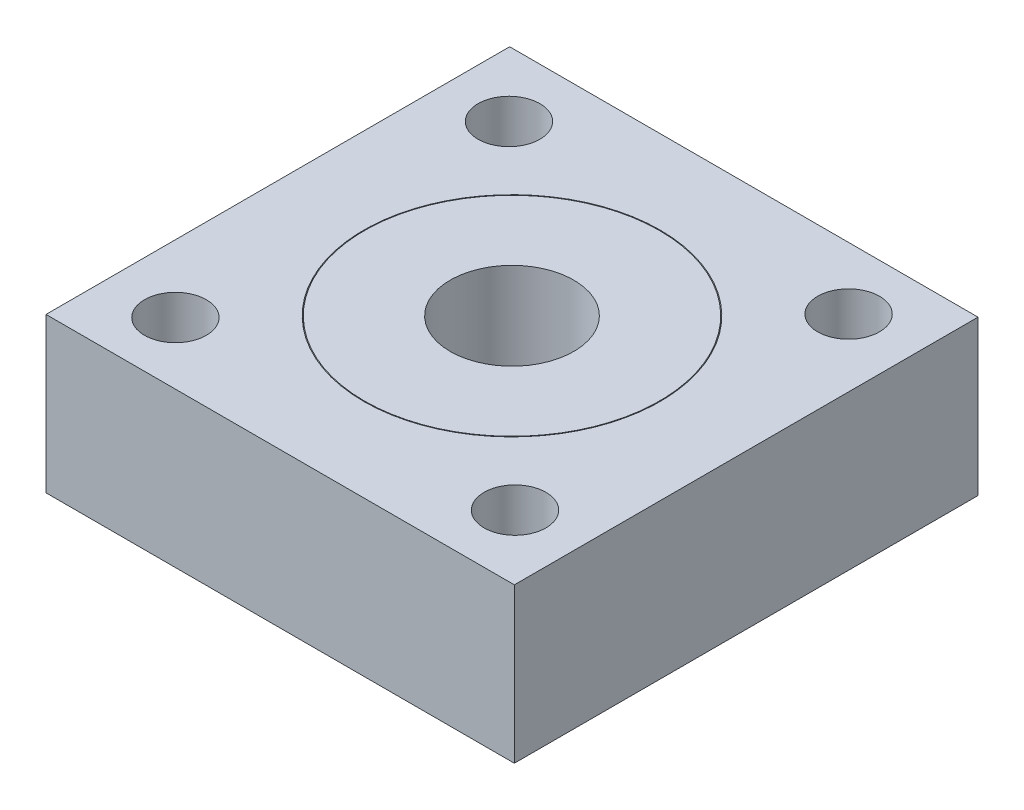
ISO-10303-21;
HEADER;
FILE_DESCRIPTION(('STEP AP214'),'2;1');
FILE_NAME('part.step','',(''),(''),'','','');
FILE_SCHEMA(('AUTOMOTIVE_DESIGN { 1 0 10303 214 1 1 1 1 }'));
ENDSEC;
DATA;
#1=APPLICATION_CONTEXT('core data for automotive mechanical design processes');
#2=APPLICATION_PROTOCOL_DEFINITION('international standard','automotive_design',2000,#1);
#3=PRODUCT_CONTEXT('',#1,'mechanical');
#4=PRODUCT('Part','Part','',(#3));
#5=PRODUCT_RELATED_PRODUCT_CATEGORY('part','',(#4));
#6=PRODUCT_DEFINITION_FORMATION('','',#4);
#7=PRODUCT_DEFINITION_CONTEXT('part definition',#1,'design');
#8=PRODUCT_DEFINITION('design','',#6,#7);
#9=PRODUCT_DEFINITION_SHAPE('','',#8);
#10=(LENGTH_UNIT() NAMED_UNIT(*) SI_UNIT(.MILLI.,.METRE.));
#11=(NAMED_UNIT(*) PLANE_ANGLE_UNIT() SI_UNIT($,.RADIAN.));
#12=(NAMED_UNIT(*) SI_UNIT($,.STERADIAN.) SOLID_ANGLE_UNIT());
#13=UNCERTAINTY_MEASURE_WITH_UNIT(LENGTH_MEASURE(1.E-05),#10,'distance_accuracy_value','');
#14=(GEOMETRIC_REPRESENTATION_CONTEXT(3) GLOBAL_UNCERTAINTY_ASSIGNED_CONTEXT((#13)) GLOBAL_UNIT_ASSIGNED_CONTEXT((#10,
#11,#12)) REPRESENTATION_CONTEXT('',''));
#15=CARTESIAN_POINT('',(0.,0.,0.));
#16=DIRECTION('',(0.,0.,1.));
#17=DIRECTION('',(1.,0.,0.));
#18=AXIS2_PLACEMENT_3D('',#15,#16,#17);
#19=CARTESIAN_POINT('',(15.1536935046579,10.,-15.0012802669847));
#20=DIRECTION('',(-1.,0.,0.));
#21=DIRECTION('',(0.,0.,1.));
#22=AXIS2_PLACEMENT_3D('',#19,#20,#21);
#23=PLANE('',#22);
#24=DIRECTION('',(0.,0.,-1.));
#25=VECTOR('',#24,1.);
#26=CARTESIAN_POINT('',(15.1536935046579,0.,-15.0012802669847));
#27=LINE('',#26,#25);
#28=CARTESIAN_POINT('',(15.1536935046579,0.,15.0012802669847));
#29=VERTEX_POINT('',#28);
#30=CARTESIAN_POINT('',(15.1536935046579,0.,-15.0012802669847));
#31=VERTEX_POINT('',#30);
#32=EDGE_CURVE('E99',#29,#31,#27,.T.);
#33=ORIENTED_EDGE('',*,*,#32,.T.);
#34=DIRECTION('',(0.,-1.,0.));
#35=VECTOR('',#34,1.);
#36=CARTESIAN_POINT('',(15.1536935046579,10.,-15.0012802669847));
#37=LINE('',#36,#35);
#38=CARTESIAN_POINT('',(15.1536935046579,10.,-15.0012802669847));
#39=VERTEX_POINT('',#38);
#40=EDGE_CURVE('E11',#39,#31,#37,.T.);
#41=ORIENTED_EDGE('',*,*,#40,.F.);
#42=DIRECTION('',(0.,0.,-1.));
#43=VECTOR('',#42,1.);
#44=CARTESIAN_POINT('',(15.1536935046579,10.,-15.0012802669847));
#45=LINE('',#44,#43);
#46=CARTESIAN_POINT('',(15.1536935046579,10.,15.0012802669847));
#47=VERTEX_POINT('',#46);
#48=EDGE_CURVE('E87',#47,#39,#45,.T.);
#49=ORIENTED_EDGE('',*,*,#48,.F.);
#50=DIRECTION('',(0.,-1.,0.));
#51=VECTOR('',#50,1.);
#52=CARTESIAN_POINT('',(15.1536935046579,10.,15.0012802669847));
#53=LINE('',#52,#51);
#54=EDGE_CURVE('E95',#47,#29,#53,.T.);
#55=ORIENTED_EDGE('',*,*,#54,.T.);
#56=EDGE_LOOP('',(#33,#41,#49,#55));
#57=FACE_BOUND('',#56,.T.);
#58=ADVANCED_FACE('F36',(#57),#23,.F.);
#59=CARTESIAN_POINT('',(-15.1536935046579,10.,-15.0012802669847));
#60=DIRECTION('',(0.,0.,1.));
#61=DIRECTION('',(1.,0.,0.));
#62=AXIS2_PLACEMENT_3D('',#59,#60,#61);
#63=PLANE('',#62);
#64=DIRECTION('',(-1.,0.,0.));
#65=VECTOR('',#64,1.);
#66=CARTESIAN_POINT('',(-15.1536935046579,0.,-15.0012802669847));
#67=LINE('',#66,#65);
#68=CARTESIAN_POINT('',(-15.1536935046579,0.,-15.0012802669847));
#69=VERTEX_POINT('',#68);
#70=EDGE_CURVE('E91',#31,#69,#67,.T.);
#71=ORIENTED_EDGE('',*,*,#70,.T.);
#72=DIRECTION('',(0.,-1.,0.));
#73=VECTOR('',#72,1.);
#74=CARTESIAN_POINT('',(-15.1536935046579,10.,-15.0012802669847));
#75=LINE('',#74,#73);
#76=CARTESIAN_POINT('',(-15.1536935046579,10.,-15.0012802669847));
#77=VERTEX_POINT('',#76);
#78=EDGE_CURVE('E44',#77,#69,#75,.T.);
#79=ORIENTED_EDGE('',*,*,#78,.F.);
#80=DIRECTION('',(-1.,0.,0.));
#81=VECTOR('',#80,1.);
#82=CARTESIAN_POINT('',(-15.1536935046579,10.,-15.0012802669847));
#83=LINE('',#82,#81);
#84=EDGE_CURVE('E82',#39,#77,#83,.T.);
#85=ORIENTED_EDGE('',*,*,#84,.F.);
#86=ORIENTED_EDGE('',*,*,#40,.T.);
#87=EDGE_LOOP('',(#71,#79,#85,#86));
#88=FACE_BOUND('',#87,.T.);
#89=ADVANCED_FACE('F90',(#88),#63,.F.);
#90=CARTESIAN_POINT('',(-15.1536935046579,10.,-15.0012802669847));
#91=DIRECTION('',(1.,0.,0.));
#92=DIRECTION('',(0.,0.,-1.));
#93=AXIS2_PLACEMENT_3D('',#90,#91,#92);
#94=PLANE('',#93);
#95=DIRECTION('',(0.,0.,1.));
#96=VECTOR('',#95,1.);
#97=CARTESIAN_POINT('',(-15.1536935046579,0.,-15.0012802669847));
#98=LINE('',#97,#96);
#99=CARTESIAN_POINT('',(-15.1536935046579,0.,15.0012802669847));
#100=VERTEX_POINT('',#99);
#101=EDGE_CURVE('E69',#69,#100,#98,.T.);
#102=ORIENTED_EDGE('',*,*,#101,.T.);
#103=DIRECTION('',(0.,-1.,0.));
#104=VECTOR('',#103,1.);
#105=CARTESIAN_POINT('',(-15.1536935046579,10.,15.0012802669847));
#106=LINE('',#105,#104);
#107=CARTESIAN_POINT('',(-15.1536935046579,10.,15.0012802669847));
#108=VERTEX_POINT('',#107);
#109=EDGE_CURVE('E92',#108,#100,#106,.T.);
#110=ORIENTED_EDGE('',*,*,#109,.F.);
#111=DIRECTION('',(0.,0.,1.));
#112=VECTOR('',#111,1.);
#113=CARTESIAN_POINT('',(-15.1536935046579,10.,-15.0012802669847));
#114=LINE('',#113,#112);
#115=EDGE_CURVE('E85',#77,#108,#114,.T.);
#116=ORIENTED_EDGE('',*,*,#115,.F.);
#117=ORIENTED_EDGE('',*,*,#78,.T.);
#118=EDGE_LOOP('',(#102,#110,#116,#117));
#119=FACE_BOUND('',#118,.T.);
#120=ADVANCED_FACE('F93',(#119),#94,.F.);
#121=CARTESIAN_POINT('',(-15.1536935046579,10.,15.0012802669847));
#122=DIRECTION('',(0.,0.,-1.));
#123=DIRECTION('',(-1.,0.,0.));
#124=AXIS2_PLACEMENT_3D('',#121,#122,#123);
#125=PLANE('',#124);
#126=DIRECTION('',(1.,0.,0.));
#127=VECTOR('',#126,1.);
#128=CARTESIAN_POINT('',(-15.1536935046579,0.,15.0012802669847));
#129=LINE('',#128,#127);
#130=EDGE_CURVE('E75',#100,#29,#129,.T.);
#131=ORIENTED_EDGE('',*,*,#130,.T.);
#132=ORIENTED_EDGE('',*,*,#54,.F.);
#133=DIRECTION('',(1.,0.,0.));
#134=VECTOR('',#133,1.);
#135=CARTESIAN_POINT('',(-15.1536935046579,10.,15.0012802669847));
#136=LINE('',#135,#134);
#137=EDGE_CURVE('E52',#108,#47,#136,.T.);
#138=ORIENTED_EDGE('',*,*,#137,.F.);
#139=ORIENTED_EDGE('',*,*,#109,.T.);
#140=EDGE_LOOP('',(#131,#132,#138,#139));
#141=FACE_BOUND('',#140,.T.);
#142=ADVANCED_FACE('F107',(#141),#125,.F.);
#143=CARTESIAN_POINT('',(0.,10.,0.));
#144=DIRECTION('',(0.,1.,0.));
#145=DIRECTION('',(0.,0.,1.));
#146=AXIS2_PLACEMENT_3D('',#143,#144,#145);
#147=PLANE('',#146);
#148=CARTESIAN_POINT('',(-10.9875097580016,10.,-10.7923497267759));
#149=DIRECTION('',(0.,1.,0.));
#150=DIRECTION('',(1.,0.,0.));
#151=AXIS2_PLACEMENT_3D('',#148,#149,#150);
#152=CIRCLE('',#151,2.);
#153=CARTESIAN_POINT('',(-8.98750975800163,10.,-10.7923497267759));
#154=VERTEX_POINT('',#153);
#155=EDGE_CURVE('E134',#154,#154,#152,.T.);
#156=ORIENTED_EDGE('',*,*,#155,.F.);
#157=EDGE_LOOP('',(#156));
#158=FACE_BOUND('',#157,.T.);
#159=CARTESIAN_POINT('',(-10.792349726776,10.,10.9875097580016));
#160=DIRECTION('',(0.,1.,0.));
#161=DIRECTION('',(0.,0.,-1.));
#162=AXIS2_PLACEMENT_3D('',#159,#160,#161);
#163=CIRCLE('',#162,2.);
#164=CARTESIAN_POINT('',(-10.792349726776,10.,8.9875097580016));
#165=VERTEX_POINT('',#164);
#166=EDGE_CURVE('E144',#165,#165,#163,.T.);
#167=ORIENTED_EDGE('',*,*,#166,.F.);
#168=EDGE_LOOP('',(#167));
#169=FACE_BOUND('',#168,.T.);
#170=CARTESIAN_POINT('',(10.9875097580017,10.,10.7923497267758));
#171=DIRECTION('',(0.,1.,0.));
#172=DIRECTION('',(-1.,0.,0.));
#173=AXIS2_PLACEMENT_3D('',#170,#171,#172);
#174=CIRCLE('',#173,2.);
#175=CARTESIAN_POINT('',(8.98750975800171,10.,10.7923497267759));
#176=VERTEX_POINT('',#175);
#177=EDGE_CURVE('E137',#176,#176,#174,.T.);
#178=ORIENTED_EDGE('',*,*,#177,.F.);
#179=EDGE_LOOP('',(#178));
#180=FACE_BOUND('',#179,.T.);
#181=CARTESIAN_POINT('',(10.792349726776,10.,-10.9875097580016));
#182=DIRECTION('',(0.,1.,0.));
#183=DIRECTION('',(0.,0.,1.));
#184=AXIS2_PLACEMENT_3D('',#181,#182,#183);
#185=CIRCLE('',#184,2.);
#186=CARTESIAN_POINT('',(10.792349726776,10.,-8.9875097580016));
#187=VERTEX_POINT('',#186);
#188=EDGE_CURVE('E131',#187,#187,#185,.T.);
#189=ORIENTED_EDGE('',*,*,#188,.F.);
#190=EDGE_LOOP('',(#189));
#191=FACE_BOUND('',#190,.T.);
#192=CARTESIAN_POINT('',(0.,10.,0.));
#193=DIRECTION('',(0.,1.,0.));
#194=DIRECTION('',(0.,0.,1.));
#195=AXIS2_PLACEMENT_3D('',#192,#193,#194);
#196=CIRCLE('',#195,9.6);
#197=CARTESIAN_POINT('',(0.,10.,9.6));
#198=VERTEX_POINT('',#197);
#199=EDGE_CURVE('E113',#198,#198,#196,.T.);
#200=ORIENTED_EDGE('',*,*,#199,.F.);
#201=EDGE_LOOP('',(#200));
#202=FACE_BOUND('',#201,.T.);
#203=ORIENTED_EDGE('',*,*,#48,.T.);
#204=ORIENTED_EDGE('',*,*,#84,.T.);
#205=ORIENTED_EDGE('',*,*,#115,.T.);
#206=ORIENTED_EDGE('',*,*,#137,.T.);
#207=EDGE_LOOP('',(#203,#204,#205,#206));
#208=FACE_BOUND('',#207,.T.);
#209=ADVANCED_FACE('F83',(#158,#169,#180,#191,#202,#208),#147,.T.);
#210=CARTESIAN_POINT('',(0.,0.,0.));
#211=DIRECTION('',(0.,1.,0.));
#212=DIRECTION('',(0.,0.,1.));
#213=AXIS2_PLACEMENT_3D('',#210,#211,#212);
#214=PLANE('',#213);
#215=CARTESIAN_POINT('',(-10.9875097580016,0.,-10.7923497267759));
#216=DIRECTION('',(0.,1.,0.));
#217=DIRECTION('',(1.,0.,0.));
#218=AXIS2_PLACEMENT_3D('',#215,#216,#217);
#219=CIRCLE('',#218,2.);
#220=CARTESIAN_POINT('',(-8.98750975800163,0.,-10.7923497267759));
#221=VERTEX_POINT('',#220);
#222=EDGE_CURVE('E147',#221,#221,#219,.T.);
#223=ORIENTED_EDGE('',*,*,#222,.T.);
#224=EDGE_LOOP('',(#223));
#225=FACE_BOUND('',#224,.T.);
#226=CARTESIAN_POINT('',(-10.792349726776,0.,10.9875097580016));
#227=DIRECTION('',(0.,1.,0.));
#228=DIRECTION('',(0.,0.,-1.));
#229=AXIS2_PLACEMENT_3D('',#226,#227,#228);
#230=CIRCLE('',#229,2.);
#231=CARTESIAN_POINT('',(-10.792349726776,0.,8.9875097580016));
#232=VERTEX_POINT('',#231);
#233=EDGE_CURVE('E140',#232,#232,#230,.T.);
#234=ORIENTED_EDGE('',*,*,#233,.T.);
#235=EDGE_LOOP('',(#234));
#236=FACE_BOUND('',#235,.T.);
#237=CARTESIAN_POINT('',(10.9875097580017,0.,10.7923497267758));
#238=DIRECTION('',(0.,1.,0.));
#239=DIRECTION('',(-1.,0.,0.));
#240=AXIS2_PLACEMENT_3D('',#237,#238,#239);
#241=CIRCLE('',#240,2.);
#242=CARTESIAN_POINT('',(8.98750975800171,0.,10.7923497267759));
#243=VERTEX_POINT('',#242);
#244=EDGE_CURVE('E141',#243,#243,#241,.T.);
#245=ORIENTED_EDGE('',*,*,#244,.T.);
#246=EDGE_LOOP('',(#245));
#247=FACE_BOUND('',#246,.T.);
#248=CARTESIAN_POINT('',(10.792349726776,0.,-10.9875097580016));
#249=DIRECTION('',(0.,1.,0.));
#250=DIRECTION('',(0.,0.,1.));
#251=AXIS2_PLACEMENT_3D('',#248,#249,#250);
#252=CIRCLE('',#251,2.);
#253=CARTESIAN_POINT('',(10.792349726776,0.,-8.9875097580016));
#254=VERTEX_POINT('',#253);
#255=EDGE_CURVE('E128',#254,#254,#252,.T.);
#256=ORIENTED_EDGE('',*,*,#255,.T.);
#257=EDGE_LOOP('',(#256));
#258=FACE_BOUND('',#257,.T.);
#259=CARTESIAN_POINT('',(0.,0.,0.));
#260=DIRECTION('',(0.,1.,0.));
#261=DIRECTION('',(0.,0.,1.));
#262=AXIS2_PLACEMENT_3D('',#259,#260,#261);
#263=CIRCLE('',#262,4.);
#264=CARTESIAN_POINT('',(0.,0.,4.));
#265=VERTEX_POINT('',#264);
#266=EDGE_CURVE('E122',#265,#265,#263,.T.);
#267=ORIENTED_EDGE('',*,*,#266,.T.);
#268=EDGE_LOOP('',(#267));
#269=FACE_BOUND('',#268,.T.);
#270=ORIENTED_EDGE('',*,*,#32,.F.);
#271=ORIENTED_EDGE('',*,*,#130,.F.);
#272=ORIENTED_EDGE('',*,*,#101,.F.);
#273=ORIENTED_EDGE('',*,*,#70,.F.);
#274=EDGE_LOOP('',(#270,#271,#272,#273));
#275=FACE_BOUND('',#274,.T.);
#276=ADVANCED_FACE('F110',(#225,#236,#247,#258,#269,#275),#214,.F.);
#277=CARTESIAN_POINT('',(0.,3.,0.));
#278=DIRECTION('',(0.,1.,0.));
#279=DIRECTION('',(0.,0.,1.));
#280=AXIS2_PLACEMENT_3D('',#277,#278,#279);
#281=CYLINDRICAL_SURFACE('',#280,9.6);
#282=CARTESIAN_POINT('',(0.,3.,0.));
#283=DIRECTION('',(0.,1.,0.));
#284=DIRECTION('',(0.,0.,1.));
#285=AXIS2_PLACEMENT_3D('',#282,#283,#284);
#286=CIRCLE('',#285,9.6);
#287=CARTESIAN_POINT('',(0.,3.,9.6));
#288=VERTEX_POINT('',#287);
#289=EDGE_CURVE('E102',#288,#288,#286,.T.);
#290=ORIENTED_EDGE('',*,*,#289,.F.);
#291=EDGE_LOOP('',(#290));
#292=FACE_BOUND('',#291,.T.);
#293=ORIENTED_EDGE('',*,*,#199,.T.);
#294=EDGE_LOOP('',(#293));
#295=FACE_BOUND('',#294,.T.);
#296=ADVANCED_FACE('F176',(#292,#295),#281,.F.);
#297=CARTESIAN_POINT('',(0.,3.,0.));
#298=DIRECTION('',(0.,1.,0.));
#299=DIRECTION('',(0.,0.,1.));
#300=AXIS2_PLACEMENT_3D('',#297,#298,#299);
#301=PLANE('',#300);
#302=CARTESIAN_POINT('',(0.,3.,0.));
#303=DIRECTION('',(0.,1.,0.));
#304=DIRECTION('',(0.,0.,1.));
#305=AXIS2_PLACEMENT_3D('',#302,#303,#304);
#306=CIRCLE('',#305,9.55);
#307=CARTESIAN_POINT('',(0.,3.,9.55));
#308=VERTEX_POINT('',#307);
#309=EDGE_CURVE('E116',#308,#308,#306,.T.);
#310=ORIENTED_EDGE('',*,*,#309,.F.);
#311=EDGE_LOOP('',(#310));
#312=FACE_BOUND('',#311,.T.);
#313=ORIENTED_EDGE('',*,*,#289,.T.);
#314=EDGE_LOOP('',(#313));
#315=FACE_BOUND('',#314,.T.);
#316=ADVANCED_FACE('F178',(#312,#315),#301,.T.);
#317=CARTESIAN_POINT('',(0.,3.,0.));
#318=DIRECTION('',(0.,1.,0.));
#319=DIRECTION('',(0.,0.,1.));
#320=AXIS2_PLACEMENT_3D('',#317,#318,#319);
#321=CYLINDRICAL_SURFACE('',#320,9.55);
#322=ORIENTED_EDGE('',*,*,#309,.T.);
#323=EDGE_LOOP('',(#322));
#324=FACE_BOUND('',#323,.T.);
#325=CARTESIAN_POINT('',(0.,10.,0.));
#326=DIRECTION('',(0.,1.,0.));
#327=DIRECTION('',(0.,0.,1.));
#328=AXIS2_PLACEMENT_3D('',#325,#326,#327);
#329=CIRCLE('',#328,9.55);
#330=CARTESIAN_POINT('',(0.,10.,9.55));
#331=VERTEX_POINT('',#330);
#332=EDGE_CURVE('E119',#331,#331,#329,.T.);
#333=ORIENTED_EDGE('',*,*,#332,.F.);
#334=EDGE_LOOP('',(#333));
#335=FACE_BOUND('',#334,.T.);
#336=ADVANCED_FACE('F185',(#324,#335),#321,.T.);
#337=CARTESIAN_POINT('',(0.,10.,0.));
#338=DIRECTION('',(0.,1.,0.));
#339=DIRECTION('',(0.,0.,1.));
#340=AXIS2_PLACEMENT_3D('',#337,#338,#339);
#341=CIRCLE('',#340,4.);
#342=CARTESIAN_POINT('',(0.,10.,4.));
#343=VERTEX_POINT('',#342);
#344=EDGE_CURVE('E125',#343,#343,#341,.T.);
#345=ORIENTED_EDGE('',*,*,#344,.F.);
#346=EDGE_LOOP('',(#345));
#347=FACE_BOUND('',#346,.T.);
#348=ORIENTED_EDGE('',*,*,#332,.T.);
#349=EDGE_LOOP('',(#348));
#350=FACE_BOUND('',#349,.T.);
#351=ADVANCED_FACE('F167',(#347,#350),#147,.T.);
#352=CARTESIAN_POINT('',(0.,0.,0.));
#353=DIRECTION('',(0.,1.,0.));
#354=DIRECTION('',(0.,0.,1.));
#355=AXIS2_PLACEMENT_3D('',#352,#353,#354);
#356=CYLINDRICAL_SURFACE('',#355,4.);
#357=ORIENTED_EDGE('',*,*,#266,.F.);
#358=EDGE_LOOP('',(#357));
#359=FACE_BOUND('',#358,.T.);
#360=ORIENTED_EDGE('',*,*,#344,.T.);
#361=EDGE_LOOP('',(#360));
#362=FACE_BOUND('',#361,.T.);
#363=ADVANCED_FACE('F250',(#359,#362),#356,.F.);
#364=CARTESIAN_POINT('',(10.792349726776,0.,-10.9875097580016));
#365=DIRECTION('',(0.,1.,0.));
#366=DIRECTION('',(0.,0.,1.));
#367=AXIS2_PLACEMENT_3D('',#364,#365,#366);
#368=CYLINDRICAL_SURFACE('',#367,2.);
#369=ORIENTED_EDGE('',*,*,#255,.F.);
#370=EDGE_LOOP('',(#369));
#371=FACE_BOUND('',#370,.T.);
#372=ORIENTED_EDGE('',*,*,#188,.T.);
#373=EDGE_LOOP('',(#372));
#374=FACE_BOUND('',#373,.T.);
#375=ADVANCED_FACE('F224',(#371,#374),#368,.F.);
#376=CARTESIAN_POINT('',(10.9875097580017,0.,10.7923497267758));
#377=DIRECTION('',(0.,1.,0.));
#378=DIRECTION('',(-1.,0.,0.));
#379=AXIS2_PLACEMENT_3D('',#376,#377,#378);
#380=CYLINDRICAL_SURFACE('',#379,2.);
#381=ORIENTED_EDGE('',*,*,#244,.F.);
#382=EDGE_LOOP('',(#381));
#383=FACE_BOUND('',#382,.T.);
#384=ORIENTED_EDGE('',*,*,#177,.T.);
#385=EDGE_LOOP('',(#384));
#386=FACE_BOUND('',#385,.T.);
#387=ADVANCED_FACE('F219',(#383,#386),#380,.F.);
#388=CARTESIAN_POINT('',(-10.792349726776,0.,10.9875097580016));
#389=DIRECTION('',(0.,1.,0.));
#390=DIRECTION('',(0.,0.,-1.));
#391=AXIS2_PLACEMENT_3D('',#388,#389,#390);
#392=CYLINDRICAL_SURFACE('',#391,2.);
#393=ORIENTED_EDGE('',*,*,#233,.F.);
#394=EDGE_LOOP('',(#393));
#395=FACE_BOUND('',#394,.T.);
#396=ORIENTED_EDGE('',*,*,#166,.T.);
#397=EDGE_LOOP('',(#396));
#398=FACE_BOUND('',#397,.T.);
#399=ADVANCED_FACE('F160',(#395,#398),#392,.F.);
#400=CARTESIAN_POINT('',(-10.9875097580016,0.,-10.7923497267759));
#401=DIRECTION('',(0.,1.,0.));
#402=DIRECTION('',(1.,0.,0.));
#403=AXIS2_PLACEMENT_3D('',#400,#401,#402);
#404=CYLINDRICAL_SURFACE('',#403,2.);
#405=ORIENTED_EDGE('',*,*,#222,.F.);
#406=EDGE_LOOP('',(#405));
#407=FACE_BOUND('',#406,.T.);
#408=ORIENTED_EDGE('',*,*,#155,.T.);
#409=EDGE_LOOP('',(#408));
#410=FACE_BOUND('',#409,.T.);
#411=ADVANCED_FACE('F157',(#407,#410),#404,.F.);
#412=CLOSED_SHELL('',(#58,#89,#120,#142,#209,#276,#296,#316,#336,#351,#363,#375,#387,#399,#411));
#413=MANIFOLD_SOLID_BREP('B2',#412);
#414=ADVANCED_BREP_SHAPE_REPRESENTATION('',(#18,#413),#14);
#415=SHAPE_DEFINITION_REPRESENTATION(#9,#414);
ENDSEC;
END-ISO-10303-21;
